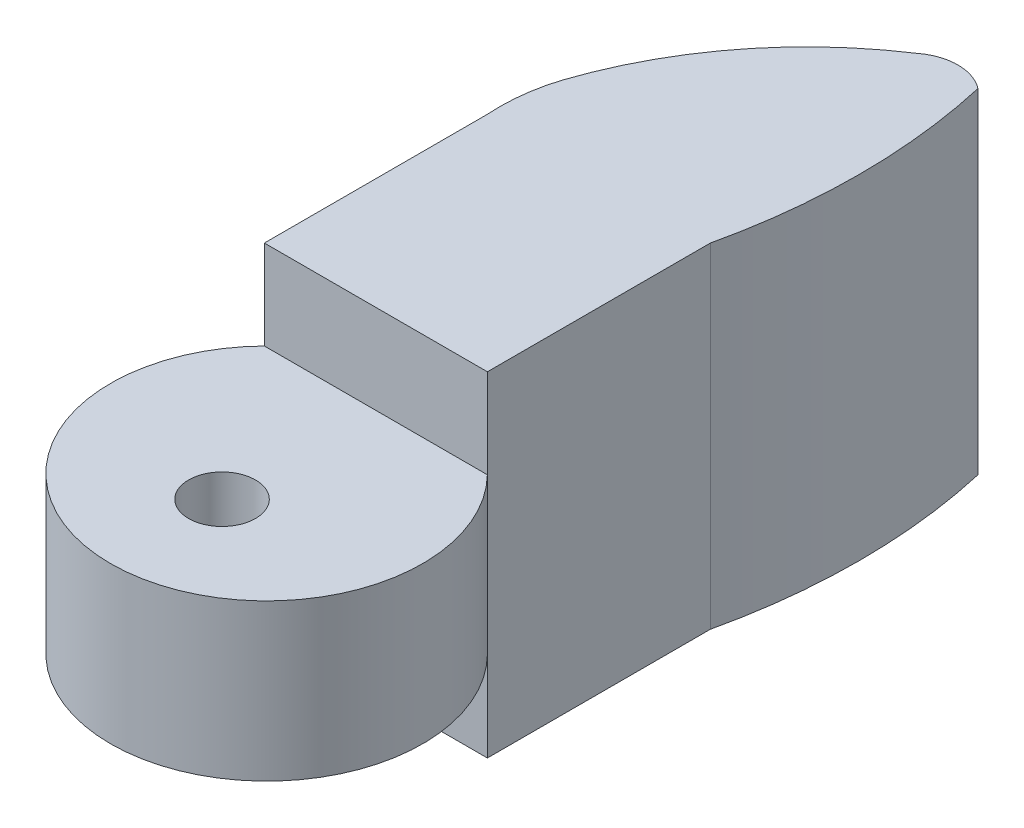
ISO-10303-21;
HEADER;
FILE_DESCRIPTION(('STEP AP214'),'2;1');
FILE_NAME('part.step','',(''),(''),'','','');
FILE_SCHEMA(('AUTOMOTIVE_DESIGN { 1 0 10303 214 1 1 1 1 }'));
ENDSEC;
DATA;
#1=APPLICATION_CONTEXT('core data for automotive mechanical design processes');
#2=APPLICATION_PROTOCOL_DEFINITION('international standard','automotive_design',2000,#1);
#3=PRODUCT_CONTEXT('',#1,'mechanical');
#4=PRODUCT('Part','Part','',(#3));
#5=PRODUCT_RELATED_PRODUCT_CATEGORY('part','',(#4));
#6=PRODUCT_DEFINITION_FORMATION('','',#4);
#7=PRODUCT_DEFINITION_CONTEXT('part definition',#1,'design');
#8=PRODUCT_DEFINITION('design','',#6,#7);
#9=PRODUCT_DEFINITION_SHAPE('','',#8);
#10=(LENGTH_UNIT() NAMED_UNIT(*) SI_UNIT(.MILLI.,.METRE.));
#11=(NAMED_UNIT(*) PLANE_ANGLE_UNIT() SI_UNIT($,.RADIAN.));
#12=(NAMED_UNIT(*) SI_UNIT($,.STERADIAN.) SOLID_ANGLE_UNIT());
#13=UNCERTAINTY_MEASURE_WITH_UNIT(LENGTH_MEASURE(1.E-05),#10,'distance_accuracy_value','');
#14=(GEOMETRIC_REPRESENTATION_CONTEXT(3) GLOBAL_UNCERTAINTY_ASSIGNED_CONTEXT((#13)) GLOBAL_UNIT_ASSIGNED_CONTEXT((#10,
#11,#12)) REPRESENTATION_CONTEXT('',''));
#15=CARTESIAN_POINT('',(0.,0.,0.));
#16=DIRECTION('',(0.,0.,1.));
#17=DIRECTION('',(1.,0.,0.));
#18=AXIS2_PLACEMENT_3D('',#15,#16,#17);
#19=CARTESIAN_POINT('',(0.,0.,12.7));
#20=DIRECTION('',(0.,0.,-1.));
#21=DIRECTION('',(-1.,0.,0.));
#22=AXIS2_PLACEMENT_3D('',#19,#20,#21);
#23=PLANE('',#22);
#24=DIRECTION('',(1.,0.,0.));
#25=VECTOR('',#24,1.);
#26=CARTESIAN_POINT('',(-6.35,-4.445,12.7));
#27=LINE('',#26,#25);
#28=CARTESIAN_POINT('',(-6.35,-4.445,12.7));
#29=VERTEX_POINT('',#28);
#30=CARTESIAN_POINT('',(6.35,-4.445,12.7));
#31=VERTEX_POINT('',#30);
#32=EDGE_CURVE('E113',#29,#31,#27,.T.);
#33=ORIENTED_EDGE('',*,*,#32,.F.);
#34=DIRECTION('',(0.,1.,0.));
#35=VECTOR('',#34,1.);
#36=CARTESIAN_POINT('',(-6.35,-9.525,12.7));
#37=LINE('',#36,#35);
#38=CARTESIAN_POINT('',(-6.35,-9.525,12.7));
#39=VERTEX_POINT('',#38);
#40=EDGE_CURVE('E175',#39,#29,#37,.T.);
#41=ORIENTED_EDGE('',*,*,#40,.F.);
#42=DIRECTION('',(1.,0.,0.));
#43=VECTOR('',#42,1.);
#44=CARTESIAN_POINT('',(-6.35,-9.525,12.7));
#45=LINE('',#44,#43);
#46=CARTESIAN_POINT('',(6.35,-9.525,12.7));
#47=VERTEX_POINT('',#46);
#48=EDGE_CURVE('E116',#39,#47,#45,.T.);
#49=ORIENTED_EDGE('',*,*,#48,.T.);
#50=DIRECTION('',(0.,1.,0.));
#51=VECTOR('',#50,1.);
#52=CARTESIAN_POINT('',(6.35,-9.525,12.7));
#53=LINE('',#52,#51);
#54=EDGE_CURVE('E109',#47,#31,#53,.T.);
#55=ORIENTED_EDGE('',*,*,#54,.T.);
#56=EDGE_LOOP('',(#33,#41,#49,#55));
#57=FACE_BOUND('',#56,.T.);
#58=ADVANCED_FACE('F38',(#57),#23,.F.);
#59=CARTESIAN_POINT('',(-6.35,-9.525,12.7));
#60=DIRECTION('',(-1.,0.,0.));
#61=DIRECTION('',(0.,0.,1.));
#62=AXIS2_PLACEMENT_3D('',#59,#60,#61);
#63=PLANE('',#62);
#64=DIRECTION('',(0.,1.,0.));
#65=VECTOR('',#64,1.);
#66=CARTESIAN_POINT('',(-6.35,-9.525,0.));
#67=LINE('',#66,#65);
#68=CARTESIAN_POINT('',(-6.35,-9.525,0.));
#69=VERTEX_POINT('',#68);
#70=CARTESIAN_POINT('',(-6.35,9.525,0.));
#71=VERTEX_POINT('',#70);
#72=EDGE_CURVE('E171',#69,#71,#67,.T.);
#73=ORIENTED_EDGE('',*,*,#72,.F.);
#74=DIRECTION('',(0.,0.,-1.));
#75=VECTOR('',#74,1.);
#76=CARTESIAN_POINT('',(-6.35,-9.525,12.7));
#77=LINE('',#76,#75);
#78=EDGE_CURVE('E11',#39,#69,#77,.T.);
#79=ORIENTED_EDGE('',*,*,#78,.F.);
#80=ORIENTED_EDGE('',*,*,#40,.T.);
#81=DIRECTION('',(0.,-1.,0.));
#82=VECTOR('',#81,1.);
#83=CARTESIAN_POINT('',(-6.35,4.445,12.7));
#84=LINE('',#83,#82);
#85=CARTESIAN_POINT('',(-6.35,4.445,12.7));
#86=VERTEX_POINT('',#85);
#87=EDGE_CURVE('E132',#86,#29,#84,.T.);
#88=ORIENTED_EDGE('',*,*,#87,.F.);
#89=CARTESIAN_POINT('',(-6.35,9.525,12.7));
#90=VERTEX_POINT('',#89);
#91=EDGE_CURVE('E60',#86,#90,#37,.T.);
#92=ORIENTED_EDGE('',*,*,#91,.T.);
#93=DIRECTION('',(0.,0.,-1.));
#94=VECTOR('',#93,1.);
#95=CARTESIAN_POINT('',(-6.35,9.525,12.7));
#96=LINE('',#95,#94);
#97=EDGE_CURVE('E42',#90,#71,#96,.T.);
#98=ORIENTED_EDGE('',*,*,#97,.T.);
#99=EDGE_LOOP('',(#73,#79,#80,#88,#92,#98));
#100=FACE_BOUND('',#99,.T.);
#101=ADVANCED_FACE('F40',(#100),#63,.T.);
#102=CARTESIAN_POINT('',(-6.35,-9.525,12.7));
#103=DIRECTION('',(0.,1.,0.));
#104=DIRECTION('',(0.,0.,1.));
#105=AXIS2_PLACEMENT_3D('',#102,#103,#104);
#106=PLANE('',#105);
#107=ORIENTED_EDGE('',*,*,#78,.T.);
#108=CARTESIAN_POINT('',(4.04475643198901,-9.525,-0.716793268686105));
#109=DIRECTION('',(0.,-1.,0.));
#110=DIRECTION('',(0.,0.,-1.));
#111=AXIS2_PLACEMENT_3D('',#108,#109,#110);
#112=CIRCLE('',#111,10.4194411496208);
#113=CARTESIAN_POINT('',(-5.91274956208207,-9.525,-3.78482655541052));
#114=VERTEX_POINT('',#113);
#115=EDGE_CURVE('E131',#69,#114,#112,.T.);
#116=ORIENTED_EDGE('',*,*,#115,.T.);
#117=CARTESIAN_POINT('',(14.9700210627901,-9.525,3.14252077058344));
#118=DIRECTION('',(0.,1.,0.));
#119=DIRECTION('',(0.,0.,1.));
#120=AXIS2_PLACEMENT_3D('',#117,#118,#119);
#121=CIRCLE('',#120,22.0017783359886);
#122=CARTESIAN_POINT('',(2.88030725041854,-9.525,-15.24));
#123=VERTEX_POINT('',#122);
#124=EDGE_CURVE('E150',#123,#114,#121,.T.);
#125=ORIENTED_EDGE('',*,*,#124,.F.);
#126=CARTESIAN_POINT('',(4.61515362520927,-9.525,-12.9891776539965));
#127=DIRECTION('',(0.,1.,0.));
#128=DIRECTION('',(0.,0.,1.));
#129=AXIS2_PLACEMENT_3D('',#126,#127,#128);
#130=CIRCLE('',#129,2.84181160131934);
#131=CARTESIAN_POINT('',(6.34999999999999,-9.525,-15.24));
#132=VERTEX_POINT('',#131);
#133=EDGE_CURVE('E153',#132,#123,#130,.T.);
#134=ORIENTED_EDGE('',*,*,#133,.F.);
#135=CARTESIAN_POINT('',(-27.1059909936101,-9.525,-7.62));
#136=DIRECTION('',(0.,1.,0.));
#137=DIRECTION('',(0.,0.,1.));
#138=AXIS2_PLACEMENT_3D('',#135,#136,#137);
#139=CIRCLE('',#138,34.3127925614416);
#140=CARTESIAN_POINT('',(6.35,-9.525,0.));
#141=VERTEX_POINT('',#140);
#142=EDGE_CURVE('E156',#141,#132,#139,.T.);
#143=ORIENTED_EDGE('',*,*,#142,.F.);
#144=DIRECTION('',(0.,0.,-1.));
#145=VECTOR('',#144,1.);
#146=CARTESIAN_POINT('',(6.35,-9.525,12.7));
#147=LINE('',#146,#145);
#148=EDGE_CURVE('E47',#47,#141,#147,.T.);
#149=ORIENTED_EDGE('',*,*,#148,.F.);
#150=ORIENTED_EDGE('',*,*,#48,.F.);
#151=EDGE_LOOP('',(#107,#116,#125,#134,#143,#149,#150));
#152=FACE_BOUND('',#151,.T.);
#153=ADVANCED_FACE('F211',(#152),#106,.F.);
#154=CARTESIAN_POINT('',(6.35,-9.525,12.7));
#155=DIRECTION('',(-1.,0.,0.));
#156=DIRECTION('',(0.,0.,1.));
#157=AXIS2_PLACEMENT_3D('',#154,#155,#156);
#158=PLANE('',#157);
#159=DIRECTION('',(0.,1.,0.));
#160=VECTOR('',#159,1.);
#161=CARTESIAN_POINT('',(6.35,-9.525,0.));
#162=LINE('',#161,#160);
#163=CARTESIAN_POINT('',(6.35,9.525,0.));
#164=VERTEX_POINT('',#163);
#165=EDGE_CURVE('E182',#141,#164,#162,.T.);
#166=ORIENTED_EDGE('',*,*,#165,.T.);
#167=DIRECTION('',(0.,0.,-1.));
#168=VECTOR('',#167,1.);
#169=CARTESIAN_POINT('',(6.35,9.525,12.7));
#170=LINE('',#169,#168);
#171=CARTESIAN_POINT('',(6.35,9.525,12.7));
#172=VERTEX_POINT('',#171);
#173=EDGE_CURVE('E184',#172,#164,#170,.T.);
#174=ORIENTED_EDGE('',*,*,#173,.F.);
#175=CARTESIAN_POINT('',(6.35,4.445,12.7));
#176=VERTEX_POINT('',#175);
#177=EDGE_CURVE('E120',#176,#172,#53,.T.);
#178=ORIENTED_EDGE('',*,*,#177,.F.);
#179=DIRECTION('',(0.,-1.,0.));
#180=VECTOR('',#179,1.);
#181=CARTESIAN_POINT('',(6.35,4.445,12.7));
#182=LINE('',#181,#180);
#183=EDGE_CURVE('E123',#176,#31,#182,.T.);
#184=ORIENTED_EDGE('',*,*,#183,.T.);
#185=ORIENTED_EDGE('',*,*,#54,.F.);
#186=ORIENTED_EDGE('',*,*,#148,.T.);
#187=EDGE_LOOP('',(#166,#174,#178,#184,#185,#186));
#188=FACE_BOUND('',#187,.T.);
#189=ADVANCED_FACE('F126',(#188),#158,.F.);
#190=CARTESIAN_POINT('',(-6.35,9.525,12.7));
#191=DIRECTION('',(0.,1.,0.));
#192=DIRECTION('',(0.,0.,1.));
#193=AXIS2_PLACEMENT_3D('',#190,#191,#192);
#194=PLANE('',#193);
#195=ORIENTED_EDGE('',*,*,#173,.T.);
#196=CARTESIAN_POINT('',(-27.1059909936101,9.525,-7.62));
#197=DIRECTION('',(0.,1.,0.));
#198=DIRECTION('',(0.,0.,1.));
#199=AXIS2_PLACEMENT_3D('',#196,#197,#198);
#200=CIRCLE('',#199,34.3127925614416);
#201=CARTESIAN_POINT('',(6.34999999999999,9.525,-15.24));
#202=VERTEX_POINT('',#201);
#203=EDGE_CURVE('E166',#164,#202,#200,.T.);
#204=ORIENTED_EDGE('',*,*,#203,.T.);
#205=CARTESIAN_POINT('',(4.61515362520927,9.525,-12.9891776539965));
#206=DIRECTION('',(0.,1.,0.));
#207=DIRECTION('',(0.,0.,1.));
#208=AXIS2_PLACEMENT_3D('',#205,#206,#207);
#209=CIRCLE('',#208,2.84181160131934);
#210=CARTESIAN_POINT('',(2.88030725041854,9.525,-15.24));
#211=VERTEX_POINT('',#210);
#212=EDGE_CURVE('E164',#202,#211,#209,.T.);
#213=ORIENTED_EDGE('',*,*,#212,.T.);
#214=CARTESIAN_POINT('',(14.9700210627901,9.525,3.14252077058344));
#215=DIRECTION('',(0.,1.,0.));
#216=DIRECTION('',(0.,0.,1.));
#217=AXIS2_PLACEMENT_3D('',#214,#215,#216);
#218=CIRCLE('',#217,22.0017783359886);
#219=CARTESIAN_POINT('',(-5.91274956208207,9.525,-3.78482655541052));
#220=VERTEX_POINT('',#219);
#221=EDGE_CURVE('E162',#211,#220,#218,.T.);
#222=ORIENTED_EDGE('',*,*,#221,.T.);
#223=CARTESIAN_POINT('',(4.04475643198901,9.525,-0.716793268686105));
#224=DIRECTION('',(0.,-1.,0.));
#225=DIRECTION('',(0.,0.,-1.));
#226=AXIS2_PLACEMENT_3D('',#223,#224,#225);
#227=CIRCLE('',#226,10.4194411496208);
#228=EDGE_CURVE('E159',#71,#220,#227,.T.);
#229=ORIENTED_EDGE('',*,*,#228,.F.);
#230=ORIENTED_EDGE('',*,*,#97,.F.);
#231=DIRECTION('',(1.,0.,0.));
#232=VECTOR('',#231,1.);
#233=CARTESIAN_POINT('',(-6.35,9.525,12.7));
#234=LINE('',#233,#232);
#235=EDGE_CURVE('E177',#90,#172,#234,.T.);
#236=ORIENTED_EDGE('',*,*,#235,.T.);
#237=EDGE_LOOP('',(#195,#204,#213,#222,#229,#230,#236));
#238=FACE_BOUND('',#237,.T.);
#239=ADVANCED_FACE('F192',(#238),#194,.T.);
#240=ORIENTED_EDGE('',*,*,#91,.F.);
#241=DIRECTION('',(1.,0.,0.));
#242=VECTOR('',#241,1.);
#243=CARTESIAN_POINT('',(-6.35,4.445,12.7));
#244=LINE('',#243,#242);
#245=EDGE_CURVE('E55',#86,#176,#244,.T.);
#246=ORIENTED_EDGE('',*,*,#245,.T.);
#247=ORIENTED_EDGE('',*,*,#177,.T.);
#248=ORIENTED_EDGE('',*,*,#235,.F.);
#249=EDGE_LOOP('',(#240,#246,#247,#248));
#250=FACE_BOUND('',#249,.T.);
#251=ADVANCED_FACE('F193',(#250),#23,.F.);
#252=CARTESIAN_POINT('',(4.04475643198901,9.525,-0.716793268686105));
#253=DIRECTION('',(0.,-1.,0.));
#254=DIRECTION('',(0.,0.,-1.));
#255=AXIS2_PLACEMENT_3D('',#252,#253,#254);
#256=CYLINDRICAL_SURFACE('',#255,10.4194411496208);
#257=DIRECTION('',(0.,-1.,0.));
#258=VECTOR('',#257,1.);
#259=CARTESIAN_POINT('',(-5.91274956208207,9.525,-3.78482655541052));
#260=LINE('',#259,#258);
#261=EDGE_CURVE('E168',#220,#114,#260,.T.);
#262=ORIENTED_EDGE('',*,*,#261,.T.);
#263=ORIENTED_EDGE('',*,*,#115,.F.);
#264=ORIENTED_EDGE('',*,*,#72,.T.);
#265=ORIENTED_EDGE('',*,*,#228,.T.);
#266=EDGE_LOOP('',(#262,#263,#264,#265));
#267=FACE_BOUND('',#266,.T.);
#268=ADVANCED_FACE('F209',(#267),#256,.T.);
#269=CARTESIAN_POINT('',(-27.1059909936101,9.525,-7.62));
#270=DIRECTION('',(0.,-1.,0.));
#271=DIRECTION('',(0.,0.,-1.));
#272=AXIS2_PLACEMENT_3D('',#269,#270,#271);
#273=CYLINDRICAL_SURFACE('',#272,34.3127925614416);
#274=ORIENTED_EDGE('',*,*,#165,.F.);
#275=ORIENTED_EDGE('',*,*,#142,.T.);
#276=DIRECTION('',(0.,-1.,0.));
#277=VECTOR('',#276,1.);
#278=CARTESIAN_POINT('',(6.34999999999999,9.525,-15.24));
#279=LINE('',#278,#277);
#280=EDGE_CURVE('E169',#202,#132,#279,.T.);
#281=ORIENTED_EDGE('',*,*,#280,.F.);
#282=ORIENTED_EDGE('',*,*,#203,.F.);
#283=EDGE_LOOP('',(#274,#275,#281,#282));
#284=FACE_BOUND('',#283,.T.);
#285=ADVANCED_FACE('F196',(#284),#273,.T.);
#286=CARTESIAN_POINT('',(4.61515362520927,9.525,-12.9891776539965));
#287=DIRECTION('',(0.,-1.,0.));
#288=DIRECTION('',(0.,0.,-1.));
#289=AXIS2_PLACEMENT_3D('',#286,#287,#288);
#290=CYLINDRICAL_SURFACE('',#289,2.84181160131934);
#291=ORIENTED_EDGE('',*,*,#280,.T.);
#292=ORIENTED_EDGE('',*,*,#133,.T.);
#293=DIRECTION('',(0.,-1.,0.));
#294=VECTOR('',#293,1.);
#295=CARTESIAN_POINT('',(2.88030725041854,9.525,-15.24));
#296=LINE('',#295,#294);
#297=EDGE_CURVE('E172',#211,#123,#296,.T.);
#298=ORIENTED_EDGE('',*,*,#297,.F.);
#299=ORIENTED_EDGE('',*,*,#212,.F.);
#300=EDGE_LOOP('',(#291,#292,#298,#299));
#301=FACE_BOUND('',#300,.T.);
#302=ADVANCED_FACE('F203',(#301),#290,.T.);
#303=CARTESIAN_POINT('',(14.9700210627901,9.525,3.14252077058344));
#304=DIRECTION('',(0.,-1.,0.));
#305=DIRECTION('',(0.,0.,-1.));
#306=AXIS2_PLACEMENT_3D('',#303,#304,#305);
#307=CYLINDRICAL_SURFACE('',#306,22.0017783359886);
#308=ORIENTED_EDGE('',*,*,#297,.T.);
#309=ORIENTED_EDGE('',*,*,#124,.T.);
#310=ORIENTED_EDGE('',*,*,#261,.F.);
#311=ORIENTED_EDGE('',*,*,#221,.F.);
#312=EDGE_LOOP('',(#308,#309,#310,#311));
#313=FACE_BOUND('',#312,.T.);
#314=ADVANCED_FACE('F207',(#313),#307,.T.);
#315=CARTESIAN_POINT('',(0.,4.445,18.9217039466693));
#316=DIRECTION('',(0.,-1.,0.));
#317=DIRECTION('',(0.,0.,-1.));
#318=AXIS2_PLACEMENT_3D('',#315,#316,#317);
#319=CYLINDRICAL_SURFACE('',#318,8.89);
#320=CARTESIAN_POINT('',(0.,-4.445,18.9217039466693));
#321=DIRECTION('',(0.,1.,0.));
#322=DIRECTION('',(0.,0.,1.));
#323=AXIS2_PLACEMENT_3D('',#320,#321,#322);
#324=CIRCLE('',#323,8.89);
#325=EDGE_CURVE('E136',#29,#31,#324,.T.);
#326=ORIENTED_EDGE('',*,*,#325,.T.);
#327=ORIENTED_EDGE('',*,*,#183,.F.);
#328=CARTESIAN_POINT('',(0.,4.445,18.9217039466693));
#329=DIRECTION('',(0.,1.,0.));
#330=DIRECTION('',(0.,0.,1.));
#331=AXIS2_PLACEMENT_3D('',#328,#329,#330);
#332=CIRCLE('',#331,8.89);
#333=EDGE_CURVE('E142',#86,#176,#332,.T.);
#334=ORIENTED_EDGE('',*,*,#333,.F.);
#335=ORIENTED_EDGE('',*,*,#87,.T.);
#336=EDGE_LOOP('',(#326,#327,#334,#335));
#337=FACE_BOUND('',#336,.T.);
#338=ADVANCED_FACE('F137',(#337),#319,.T.);
#339=CARTESIAN_POINT('',(0.,4.445,18.9217039466693));
#340=DIRECTION('',(0.,1.,0.));
#341=DIRECTION('',(0.,0.,1.));
#342=AXIS2_PLACEMENT_3D('',#339,#340,#341);
#343=PLANE('',#342);
#344=CARTESIAN_POINT('',(0.,4.445,21.4617039466693));
#345=DIRECTION('',(0.,1.,0.));
#346=DIRECTION('',(0.,0.,1.));
#347=AXIS2_PLACEMENT_3D('',#344,#345,#346);
#348=CIRCLE('',#347,1.905);
#349=CARTESIAN_POINT('',(0.,4.445,23.3667039466693));
#350=VERTEX_POINT('',#349);
#351=EDGE_CURVE('E217',#350,#350,#348,.T.);
#352=ORIENTED_EDGE('',*,*,#351,.F.);
#353=EDGE_LOOP('',(#352));
#354=FACE_BOUND('',#353,.T.);
#355=ORIENTED_EDGE('',*,*,#333,.T.);
#356=ORIENTED_EDGE('',*,*,#245,.F.);
#357=EDGE_LOOP('',(#355,#356));
#358=FACE_BOUND('',#357,.T.);
#359=ADVANCED_FACE('F213',(#354,#358),#343,.T.);
#360=CARTESIAN_POINT('',(0.,-4.445,18.9217039466693));
#361=DIRECTION('',(0.,1.,0.));
#362=DIRECTION('',(0.,0.,1.));
#363=AXIS2_PLACEMENT_3D('',#360,#361,#362);
#364=PLANE('',#363);
#365=CARTESIAN_POINT('',(0.,-4.445,21.4617039466693));
#366=DIRECTION('',(0.,1.,0.));
#367=DIRECTION('',(0.,0.,1.));
#368=AXIS2_PLACEMENT_3D('',#365,#366,#367);
#369=CIRCLE('',#368,1.905);
#370=CARTESIAN_POINT('',(0.,-4.445,23.3667039466693));
#371=VERTEX_POINT('',#370);
#372=EDGE_CURVE('E139',#371,#371,#369,.F.);
#373=ORIENTED_EDGE('',*,*,#372,.F.);
#374=EDGE_LOOP('',(#373));
#375=FACE_BOUND('',#374,.T.);
#376=ORIENTED_EDGE('',*,*,#325,.F.);
#377=ORIENTED_EDGE('',*,*,#32,.T.);
#378=EDGE_LOOP('',(#376,#377));
#379=FACE_BOUND('',#378,.T.);
#380=ADVANCED_FACE('F141',(#375,#379),#364,.F.);
#381=CARTESIAN_POINT('',(0.,-9.83315367264149,21.4617039466693));
#382=DIRECTION('',(0.,1.,0.));
#383=DIRECTION('',(0.,0.,1.));
#384=AXIS2_PLACEMENT_3D('',#381,#382,#383);
#385=CYLINDRICAL_SURFACE('',#384,1.905);
#386=ORIENTED_EDGE('',*,*,#372,.T.);
#387=EDGE_LOOP('',(#386));
#388=FACE_BOUND('',#387,.T.);
#389=ORIENTED_EDGE('',*,*,#351,.T.);
#390=EDGE_LOOP('',(#389));
#391=FACE_BOUND('',#390,.T.);
#392=ADVANCED_FACE('F221',(#388,#391),#385,.F.);
#393=CLOSED_SHELL('',(#58,#101,#153,#189,#239,#251,#268,#285,#302,#314,#338,#359,#380,#392));
#394=MANIFOLD_SOLID_BREP('B2',#393);
#395=ADVANCED_BREP_SHAPE_REPRESENTATION('',(#18,#394),#14);
#396=SHAPE_DEFINITION_REPRESENTATION(#9,#395);
ENDSEC;
END-ISO-10303-21;
